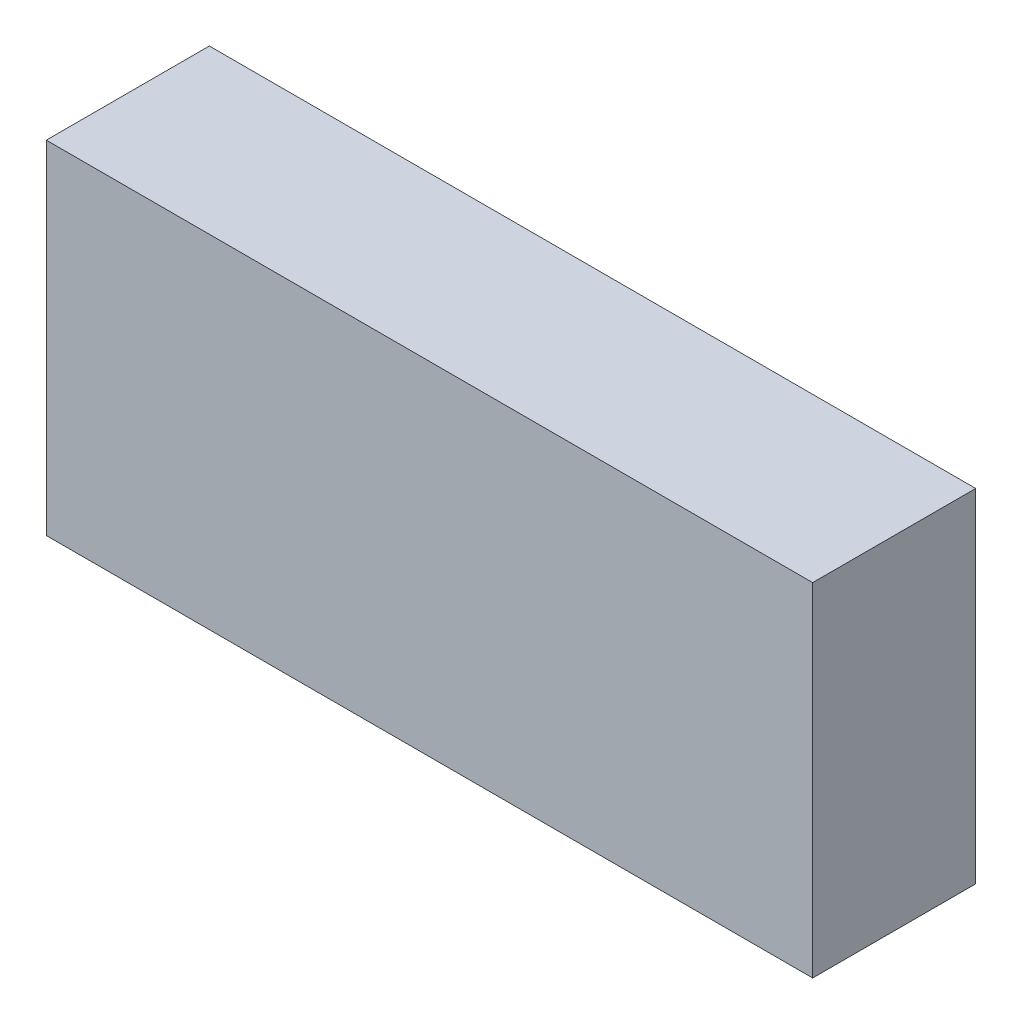
ISO-10303-21;
HEADER;
FILE_DESCRIPTION(('STEP AP214'),'2;1');
FILE_NAME('part.step','',(''),(''),'','','');
FILE_SCHEMA(('AUTOMOTIVE_DESIGN { 1 0 10303 214 1 1 1 1 }'));
ENDSEC;
DATA;
#1=APPLICATION_CONTEXT('core data for automotive mechanical design processes');
#2=APPLICATION_PROTOCOL_DEFINITION('international standard','automotive_design',2000,#1);
#3=PRODUCT_CONTEXT('',#1,'mechanical');
#4=PRODUCT('Part','Part','',(#3));
#5=PRODUCT_RELATED_PRODUCT_CATEGORY('part','',(#4));
#6=PRODUCT_DEFINITION_FORMATION('','',#4);
#7=PRODUCT_DEFINITION_CONTEXT('part definition',#1,'design');
#8=PRODUCT_DEFINITION('design','',#6,#7);
#9=PRODUCT_DEFINITION_SHAPE('','',#8);
#10=(LENGTH_UNIT() NAMED_UNIT(*) SI_UNIT(.MILLI.,.METRE.));
#11=(NAMED_UNIT(*) PLANE_ANGLE_UNIT() SI_UNIT($,.RADIAN.));
#12=(NAMED_UNIT(*) SI_UNIT($,.STERADIAN.) SOLID_ANGLE_UNIT());
#13=UNCERTAINTY_MEASURE_WITH_UNIT(LENGTH_MEASURE(1.E-05),#10,'distance_accuracy_value','');
#14=(GEOMETRIC_REPRESENTATION_CONTEXT(3) GLOBAL_UNCERTAINTY_ASSIGNED_CONTEXT((#13)) GLOBAL_UNIT_ASSIGNED_CONTEXT((#10,
#11,#12)) REPRESENTATION_CONTEXT('',''));
#15=CARTESIAN_POINT('',(0.,0.,0.));
#16=DIRECTION('',(0.,0.,1.));
#17=DIRECTION('',(1.,0.,0.));
#18=AXIS2_PLACEMENT_3D('',#15,#16,#17);
#19=CARTESIAN_POINT('',(0.,0.,5.));
#20=DIRECTION('',(1.,0.,0.));
#21=DIRECTION('',(0.,0.,-1.));
#22=AXIS2_PLACEMENT_3D('',#19,#20,#21);
#23=PLANE('',#22);
#24=DIRECTION('',(0.,-1.,0.));
#25=VECTOR('',#24,1.);
#26=CARTESIAN_POINT('',(0.,0.,0.));
#27=LINE('',#26,#25);
#28=CARTESIAN_POINT('',(0.,0.,0.));
#29=VERTEX_POINT('',#28);
#30=CARTESIAN_POINT('',(0.,-10.5,0.));
#31=VERTEX_POINT('',#30);
#32=EDGE_CURVE('E111',#29,#31,#27,.T.);
#33=ORIENTED_EDGE('',*,*,#32,.T.);
#34=DIRECTION('',(0.,0.,-1.));
#35=VECTOR('',#34,1.);
#36=CARTESIAN_POINT('',(0.,-10.5,5.));
#37=LINE('',#36,#35);
#38=CARTESIAN_POINT('',(0.,-10.5,5.));
#39=VERTEX_POINT('',#38);
#40=EDGE_CURVE('E11',#39,#31,#37,.T.);
#41=ORIENTED_EDGE('',*,*,#40,.F.);
#42=DIRECTION('',(0.,-1.,0.));
#43=VECTOR('',#42,1.);
#44=CARTESIAN_POINT('',(0.,0.,5.));
#45=LINE('',#44,#43);
#46=CARTESIAN_POINT('',(0.,0.,5.));
#47=VERTEX_POINT('',#46);
#48=EDGE_CURVE('E95',#47,#39,#45,.T.);
#49=ORIENTED_EDGE('',*,*,#48,.F.);
#50=DIRECTION('',(0.,0.,-1.));
#51=VECTOR('',#50,1.);
#52=CARTESIAN_POINT('',(0.,0.,5.));
#53=LINE('',#52,#51);
#54=EDGE_CURVE('E107',#47,#29,#53,.T.);
#55=ORIENTED_EDGE('',*,*,#54,.T.);
#56=EDGE_LOOP('',(#33,#41,#49,#55));
#57=FACE_BOUND('',#56,.T.);
#58=ADVANCED_FACE('F43',(#57),#23,.F.);
#59=CARTESIAN_POINT('',(0.,-10.5,5.));
#60=DIRECTION('',(0.,1.,0.));
#61=DIRECTION('',(-1.,0.,0.));
#62=AXIS2_PLACEMENT_3D('',#59,#60,#61);
#63=PLANE('',#62);
#64=DIRECTION('',(1.,0.,0.));
#65=VECTOR('',#64,1.);
#66=CARTESIAN_POINT('',(0.,-10.5,0.));
#67=LINE('',#66,#65);
#68=CARTESIAN_POINT('',(23.5,-10.5,0.));
#69=VERTEX_POINT('',#68);
#70=EDGE_CURVE('E100',#31,#69,#67,.T.);
#71=ORIENTED_EDGE('',*,*,#70,.T.);
#72=DIRECTION('',(0.,0.,-1.));
#73=VECTOR('',#72,1.);
#74=CARTESIAN_POINT('',(23.5,-10.5,5.));
#75=LINE('',#74,#73);
#76=CARTESIAN_POINT('',(23.5,-10.5,5.));
#77=VERTEX_POINT('',#76);
#78=EDGE_CURVE('E52',#77,#69,#75,.T.);
#79=ORIENTED_EDGE('',*,*,#78,.F.);
#80=DIRECTION('',(1.,0.,0.));
#81=VECTOR('',#80,1.);
#82=CARTESIAN_POINT('',(0.,-10.5,5.));
#83=LINE('',#82,#81);
#84=EDGE_CURVE('E90',#39,#77,#83,.T.);
#85=ORIENTED_EDGE('',*,*,#84,.F.);
#86=ORIENTED_EDGE('',*,*,#40,.T.);
#87=EDGE_LOOP('',(#71,#79,#85,#86));
#88=FACE_BOUND('',#87,.T.);
#89=ADVANCED_FACE('F99',(#88),#63,.F.);
#90=CARTESIAN_POINT('',(23.5,0.,5.));
#91=DIRECTION('',(-1.,0.,0.));
#92=DIRECTION('',(0.,0.,1.));
#93=AXIS2_PLACEMENT_3D('',#90,#91,#92);
#94=PLANE('',#93);
#95=DIRECTION('',(0.,1.,0.));
#96=VECTOR('',#95,1.);
#97=CARTESIAN_POINT('',(23.5,0.,0.));
#98=LINE('',#97,#96);
#99=CARTESIAN_POINT('',(23.5,0.,0.));
#100=VERTEX_POINT('',#99);
#101=EDGE_CURVE('E77',#69,#100,#98,.T.);
#102=ORIENTED_EDGE('',*,*,#101,.T.);
#103=DIRECTION('',(0.,0.,-1.));
#104=VECTOR('',#103,1.);
#105=CARTESIAN_POINT('',(23.5,0.,5.));
#106=LINE('',#105,#104);
#107=CARTESIAN_POINT('',(23.5,0.,5.));
#108=VERTEX_POINT('',#107);
#109=EDGE_CURVE('E102',#108,#100,#106,.T.);
#110=ORIENTED_EDGE('',*,*,#109,.F.);
#111=DIRECTION('',(0.,1.,0.));
#112=VECTOR('',#111,1.);
#113=CARTESIAN_POINT('',(23.5,0.,5.));
#114=LINE('',#113,#112);
#115=EDGE_CURVE('E93',#77,#108,#114,.T.);
#116=ORIENTED_EDGE('',*,*,#115,.F.);
#117=ORIENTED_EDGE('',*,*,#78,.T.);
#118=EDGE_LOOP('',(#102,#110,#116,#117));
#119=FACE_BOUND('',#118,.T.);
#120=ADVANCED_FACE('F103',(#119),#94,.F.);
#121=CARTESIAN_POINT('',(0.,0.,5.));
#122=DIRECTION('',(0.,-1.,0.));
#123=DIRECTION('',(0.,0.,-1.));
#124=AXIS2_PLACEMENT_3D('',#121,#122,#123);
#125=PLANE('',#124);
#126=DIRECTION('',(-1.,0.,0.));
#127=VECTOR('',#126,1.);
#128=CARTESIAN_POINT('',(0.,0.,0.));
#129=LINE('',#128,#127);
#130=EDGE_CURVE('E83',#100,#29,#129,.T.);
#131=ORIENTED_EDGE('',*,*,#130,.T.);
#132=ORIENTED_EDGE('',*,*,#54,.F.);
#133=DIRECTION('',(-1.,0.,0.));
#134=VECTOR('',#133,1.);
#135=CARTESIAN_POINT('',(0.,0.,5.));
#136=LINE('',#135,#134);
#137=EDGE_CURVE('E60',#108,#47,#136,.T.);
#138=ORIENTED_EDGE('',*,*,#137,.F.);
#139=ORIENTED_EDGE('',*,*,#109,.T.);
#140=EDGE_LOOP('',(#131,#132,#138,#139));
#141=FACE_BOUND('',#140,.T.);
#142=ADVANCED_FACE('F124',(#141),#125,.F.);
#143=CARTESIAN_POINT('',(0.,0.,5.));
#144=DIRECTION('',(0.,0.,1.));
#145=DIRECTION('',(1.,0.,0.));
#146=AXIS2_PLACEMENT_3D('',#143,#144,#145);
#147=PLANE('',#146);
#148=ORIENTED_EDGE('',*,*,#48,.T.);
#149=ORIENTED_EDGE('',*,*,#84,.T.);
#150=ORIENTED_EDGE('',*,*,#115,.T.);
#151=ORIENTED_EDGE('',*,*,#137,.T.);
#152=EDGE_LOOP('',(#148,#149,#150,#151));
#153=FACE_BOUND('',#152,.T.);
#154=ADVANCED_FACE('F91',(#153),#147,.T.);
#155=CARTESIAN_POINT('',(0.,0.,0.));
#156=DIRECTION('',(0.,0.,1.));
#157=DIRECTION('',(1.,0.,0.));
#158=AXIS2_PLACEMENT_3D('',#155,#156,#157);
#159=PLANE('',#158);
#160=ORIENTED_EDGE('',*,*,#32,.F.);
#161=ORIENTED_EDGE('',*,*,#130,.F.);
#162=ORIENTED_EDGE('',*,*,#101,.F.);
#163=ORIENTED_EDGE('',*,*,#70,.F.);
#164=EDGE_LOOP('',(#160,#161,#162,#163));
#165=FACE_BOUND('',#164,.T.);
#166=ADVANCED_FACE('F127',(#165),#159,.F.);
#167=CLOSED_SHELL('',(#58,#89,#120,#142,#154,#166));
#168=MANIFOLD_SOLID_BREP('B2',#167);
#169=ADVANCED_BREP_SHAPE_REPRESENTATION('',(#18,#168),#14);
#170=SHAPE_DEFINITION_REPRESENTATION(#9,#169);
ENDSEC;
END-ISO-10303-21;
